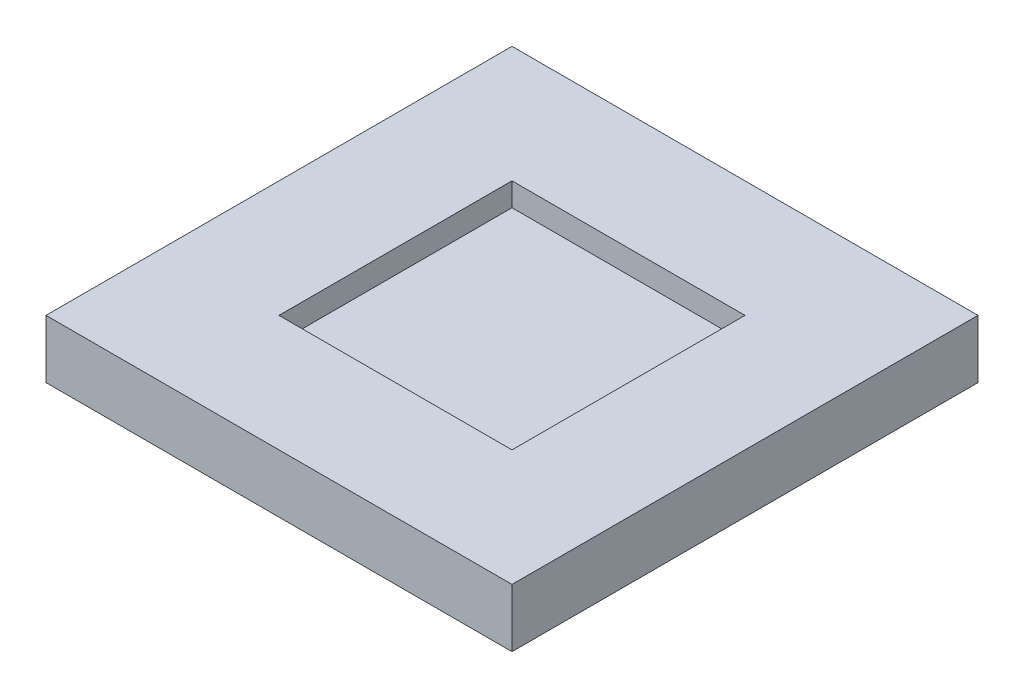
ISO-10303-21;
HEADER;
FILE_DESCRIPTION(('STEP AP214'),'2;1');
FILE_NAME('part.step','',(''),(''),'','','');
FILE_SCHEMA(('AUTOMOTIVE_DESIGN { 1 0 10303 214 1 1 1 1 }'));
ENDSEC;
DATA;
#1=APPLICATION_CONTEXT('core data for automotive mechanical design processes');
#2=APPLICATION_PROTOCOL_DEFINITION('international standard','automotive_design',2000,#1);
#3=PRODUCT_CONTEXT('',#1,'mechanical');
#4=PRODUCT('Part','Part','',(#3));
#5=PRODUCT_RELATED_PRODUCT_CATEGORY('part','',(#4));
#6=PRODUCT_DEFINITION_FORMATION('','',#4);
#7=PRODUCT_DEFINITION_CONTEXT('part definition',#1,'design');
#8=PRODUCT_DEFINITION('design','',#6,#7);
#9=PRODUCT_DEFINITION_SHAPE('','',#8);
#10=(LENGTH_UNIT() NAMED_UNIT(*) SI_UNIT(.MILLI.,.METRE.));
#11=(NAMED_UNIT(*) PLANE_ANGLE_UNIT() SI_UNIT($,.RADIAN.));
#12=(NAMED_UNIT(*) SI_UNIT($,.STERADIAN.) SOLID_ANGLE_UNIT());
#13=UNCERTAINTY_MEASURE_WITH_UNIT(LENGTH_MEASURE(1.E-05),#10,'distance_accuracy_value','');
#14=(GEOMETRIC_REPRESENTATION_CONTEXT(3) GLOBAL_UNCERTAINTY_ASSIGNED_CONTEXT((#13)) GLOBAL_UNIT_ASSIGNED_CONTEXT((#10,
#11,#12)) REPRESENTATION_CONTEXT('',''));
#15=CARTESIAN_POINT('',(0.,0.,0.));
#16=DIRECTION('',(0.,0.,1.));
#17=DIRECTION('',(1.,0.,0.));
#18=AXIS2_PLACEMENT_3D('',#15,#16,#17);
#19=CARTESIAN_POINT('',(-50.8,12.7,-50.8));
#20=DIRECTION('',(1.,0.,0.));
#21=DIRECTION('',(0.,0.,-1.));
#22=AXIS2_PLACEMENT_3D('',#19,#20,#21);
#23=PLANE('',#22);
#24=DIRECTION('',(0.,0.,1.));
#25=VECTOR('',#24,1.);
#26=CARTESIAN_POINT('',(-50.8,0.,-50.8));
#27=LINE('',#26,#25);
#28=CARTESIAN_POINT('',(-50.8,0.,-50.8));
#29=VERTEX_POINT('',#28);
#30=CARTESIAN_POINT('',(-50.8,0.,50.8));
#31=VERTEX_POINT('',#30);
#32=EDGE_CURVE('E140',#29,#31,#27,.T.);
#33=ORIENTED_EDGE('',*,*,#32,.T.);
#34=DIRECTION('',(0.,-1.,0.));
#35=VECTOR('',#34,1.);
#36=CARTESIAN_POINT('',(-50.8,12.7,50.8));
#37=LINE('',#36,#35);
#38=CARTESIAN_POINT('',(-50.8,12.7,50.8));
#39=VERTEX_POINT('',#38);
#40=EDGE_CURVE('E11',#39,#31,#37,.T.);
#41=ORIENTED_EDGE('',*,*,#40,.F.);
#42=DIRECTION('',(0.,0.,1.));
#43=VECTOR('',#42,1.);
#44=CARTESIAN_POINT('',(-50.8,12.7,-50.8));
#45=LINE('',#44,#43);
#46=CARTESIAN_POINT('',(-50.8,12.7,-50.8));
#47=VERTEX_POINT('',#46);
#48=EDGE_CURVE('E144',#47,#39,#45,.T.);
#49=ORIENTED_EDGE('',*,*,#48,.F.);
#50=DIRECTION('',(0.,-1.,0.));
#51=VECTOR('',#50,1.);
#52=CARTESIAN_POINT('',(-50.8,12.7,-50.8));
#53=LINE('',#52,#51);
#54=EDGE_CURVE('E150',#47,#29,#53,.T.);
#55=ORIENTED_EDGE('',*,*,#54,.T.);
#56=EDGE_LOOP('',(#33,#41,#49,#55));
#57=FACE_BOUND('',#56,.T.);
#58=ADVANCED_FACE('F32',(#57),#23,.F.);
#59=CARTESIAN_POINT('',(50.8,12.7,50.8));
#60=DIRECTION('',(0.,0.,-1.));
#61=DIRECTION('',(-1.,0.,0.));
#62=AXIS2_PLACEMENT_3D('',#59,#60,#61);
#63=PLANE('',#62);
#64=DIRECTION('',(1.,0.,0.));
#65=VECTOR('',#64,1.);
#66=CARTESIAN_POINT('',(50.8,0.,50.8));
#67=LINE('',#66,#65);
#68=CARTESIAN_POINT('',(50.8,0.,50.8));
#69=VERTEX_POINT('',#68);
#70=EDGE_CURVE('E153',#31,#69,#67,.T.);
#71=ORIENTED_EDGE('',*,*,#70,.T.);
#72=DIRECTION('',(0.,-1.,0.));
#73=VECTOR('',#72,1.);
#74=CARTESIAN_POINT('',(50.8,12.7,50.8));
#75=LINE('',#74,#73);
#76=CARTESIAN_POINT('',(50.8,12.7,50.8));
#77=VERTEX_POINT('',#76);
#78=EDGE_CURVE('E39',#77,#69,#75,.T.);
#79=ORIENTED_EDGE('',*,*,#78,.F.);
#80=DIRECTION('',(1.,0.,0.));
#81=VECTOR('',#80,1.);
#82=CARTESIAN_POINT('',(50.8,12.7,50.8));
#83=LINE('',#82,#81);
#84=EDGE_CURVE('E83',#39,#77,#83,.T.);
#85=ORIENTED_EDGE('',*,*,#84,.F.);
#86=ORIENTED_EDGE('',*,*,#40,.T.);
#87=EDGE_LOOP('',(#71,#79,#85,#86));
#88=FACE_BOUND('',#87,.T.);
#89=ADVANCED_FACE('F182',(#88),#63,.F.);
#90=CARTESIAN_POINT('',(50.8,12.7,-50.8));
#91=DIRECTION('',(-1.,0.,0.));
#92=DIRECTION('',(0.,0.,1.));
#93=AXIS2_PLACEMENT_3D('',#90,#91,#92);
#94=PLANE('',#93);
#95=DIRECTION('',(0.,0.,-1.));
#96=VECTOR('',#95,1.);
#97=CARTESIAN_POINT('',(50.8,0.,-50.8));
#98=LINE('',#97,#96);
#99=CARTESIAN_POINT('',(50.8,0.,-50.8));
#100=VERTEX_POINT('',#99);
#101=EDGE_CURVE('E155',#69,#100,#98,.T.);
#102=ORIENTED_EDGE('',*,*,#101,.T.);
#103=DIRECTION('',(0.,-1.,0.));
#104=VECTOR('',#103,1.);
#105=CARTESIAN_POINT('',(50.8,12.7,-50.8));
#106=LINE('',#105,#104);
#107=CARTESIAN_POINT('',(50.8,12.7,-50.8));
#108=VERTEX_POINT('',#107);
#109=EDGE_CURVE('E159',#108,#100,#106,.T.);
#110=ORIENTED_EDGE('',*,*,#109,.F.);
#111=DIRECTION('',(0.,0.,-1.));
#112=VECTOR('',#111,1.);
#113=CARTESIAN_POINT('',(50.8,12.7,-50.8));
#114=LINE('',#113,#112);
#115=EDGE_CURVE('E147',#77,#108,#114,.T.);
#116=ORIENTED_EDGE('',*,*,#115,.F.);
#117=ORIENTED_EDGE('',*,*,#78,.T.);
#118=EDGE_LOOP('',(#102,#110,#116,#117));
#119=FACE_BOUND('',#118,.T.);
#120=ADVANCED_FACE('F164',(#119),#94,.F.);
#121=CARTESIAN_POINT('',(50.8,12.7,-50.8));
#122=DIRECTION('',(0.,0.,1.));
#123=DIRECTION('',(1.,0.,0.));
#124=AXIS2_PLACEMENT_3D('',#121,#122,#123);
#125=PLANE('',#124);
#126=DIRECTION('',(-1.,0.,0.));
#127=VECTOR('',#126,1.);
#128=CARTESIAN_POINT('',(50.8,0.,-50.8));
#129=LINE('',#128,#127);
#130=EDGE_CURVE('E76',#100,#29,#129,.T.);
#131=ORIENTED_EDGE('',*,*,#130,.T.);
#132=ORIENTED_EDGE('',*,*,#54,.F.);
#133=DIRECTION('',(-1.,0.,0.));
#134=VECTOR('',#133,1.);
#135=CARTESIAN_POINT('',(50.8,12.7,-50.8));
#136=LINE('',#135,#134);
#137=EDGE_CURVE('E55',#108,#47,#136,.T.);
#138=ORIENTED_EDGE('',*,*,#137,.F.);
#139=ORIENTED_EDGE('',*,*,#109,.T.);
#140=EDGE_LOOP('',(#131,#132,#138,#139));
#141=FACE_BOUND('',#140,.T.);
#142=ADVANCED_FACE('F172',(#141),#125,.F.);
#143=CARTESIAN_POINT('',(0.,12.7,0.));
#144=DIRECTION('',(0.,-1.,0.));
#145=DIRECTION('',(0.,0.,-1.));
#146=AXIS2_PLACEMENT_3D('',#143,#144,#145);
#147=PLANE('',#146);
#148=DIRECTION('',(1.,0.,0.));
#149=VECTOR('',#148,1.);
#150=CARTESIAN_POINT('',(25.4,12.7,25.4));
#151=LINE('',#150,#149);
#152=CARTESIAN_POINT('',(-25.4,12.7,25.4));
#153=VERTEX_POINT('',#152);
#154=CARTESIAN_POINT('',(25.4,12.7,25.4));
#155=VERTEX_POINT('',#154);
#156=EDGE_CURVE('E134',#153,#155,#151,.T.);
#157=ORIENTED_EDGE('',*,*,#156,.F.);
#158=DIRECTION('',(0.,0.,1.));
#159=VECTOR('',#158,1.);
#160=CARTESIAN_POINT('',(-25.4,12.7,-25.4));
#161=LINE('',#160,#159);
#162=CARTESIAN_POINT('',(-25.4,12.7,-25.4));
#163=VERTEX_POINT('',#162);
#164=EDGE_CURVE('E46',#163,#153,#161,.T.);
#165=ORIENTED_EDGE('',*,*,#164,.F.);
#166=DIRECTION('',(-1.,0.,0.));
#167=VECTOR('',#166,1.);
#168=CARTESIAN_POINT('',(25.4,12.7,-25.4));
#169=LINE('',#168,#167);
#170=CARTESIAN_POINT('',(25.4,12.7,-25.4));
#171=VERTEX_POINT('',#170);
#172=EDGE_CURVE('E125',#171,#163,#169,.T.);
#173=ORIENTED_EDGE('',*,*,#172,.F.);
#174=DIRECTION('',(0.,0.,-1.));
#175=VECTOR('',#174,1.);
#176=CARTESIAN_POINT('',(25.4,12.7,-25.4));
#177=LINE('',#176,#175);
#178=EDGE_CURVE('E128',#155,#171,#177,.T.);
#179=ORIENTED_EDGE('',*,*,#178,.F.);
#180=EDGE_LOOP('',(#157,#165,#173,#179));
#181=FACE_BOUND('',#180,.T.);
#182=ORIENTED_EDGE('',*,*,#48,.T.);
#183=ORIENTED_EDGE('',*,*,#84,.T.);
#184=ORIENTED_EDGE('',*,*,#115,.T.);
#185=ORIENTED_EDGE('',*,*,#137,.T.);
#186=EDGE_LOOP('',(#182,#183,#184,#185));
#187=FACE_BOUND('',#186,.T.);
#188=ADVANCED_FACE('F174',(#181,#187),#147,.F.);
#189=CARTESIAN_POINT('',(0.,0.,0.));
#190=DIRECTION('',(0.,-1.,0.));
#191=DIRECTION('',(0.,0.,-1.));
#192=AXIS2_PLACEMENT_3D('',#189,#190,#191);
#193=PLANE('',#192);
#194=ORIENTED_EDGE('',*,*,#32,.F.);
#195=ORIENTED_EDGE('',*,*,#130,.F.);
#196=ORIENTED_EDGE('',*,*,#101,.F.);
#197=ORIENTED_EDGE('',*,*,#70,.F.);
#198=EDGE_LOOP('',(#194,#195,#196,#197));
#199=FACE_BOUND('',#198,.T.);
#200=ADVANCED_FACE('F168',(#199),#193,.T.);
#201=CARTESIAN_POINT('',(-25.4,7.62,-25.4));
#202=DIRECTION('',(-1.,0.,0.));
#203=DIRECTION('',(0.,0.,1.));
#204=AXIS2_PLACEMENT_3D('',#201,#202,#203);
#205=PLANE('',#204);
#206=ORIENTED_EDGE('',*,*,#164,.T.);
#207=DIRECTION('',(0.,1.,0.));
#208=VECTOR('',#207,1.);
#209=CARTESIAN_POINT('',(-25.4,7.62,25.4));
#210=LINE('',#209,#208);
#211=CARTESIAN_POINT('',(-25.4,7.62,25.4));
#212=VERTEX_POINT('',#211);
#213=EDGE_CURVE('E103',#212,#153,#210,.T.);
#214=ORIENTED_EDGE('',*,*,#213,.F.);
#215=DIRECTION('',(0.,0.,1.));
#216=VECTOR('',#215,1.);
#217=CARTESIAN_POINT('',(-25.4,7.62,-25.4));
#218=LINE('',#217,#216);
#219=CARTESIAN_POINT('',(-25.4,7.62,-25.4));
#220=VERTEX_POINT('',#219);
#221=EDGE_CURVE('E107',#220,#212,#218,.T.);
#222=ORIENTED_EDGE('',*,*,#221,.F.);
#223=DIRECTION('',(0.,1.,0.));
#224=VECTOR('',#223,1.);
#225=CARTESIAN_POINT('',(-25.4,7.62,-25.4));
#226=LINE('',#225,#224);
#227=EDGE_CURVE('E138',#220,#163,#226,.T.);
#228=ORIENTED_EDGE('',*,*,#227,.T.);
#229=EDGE_LOOP('',(#206,#214,#222,#228));
#230=FACE_BOUND('',#229,.T.);
#231=ADVANCED_FACE('F105',(#230),#205,.F.);
#232=CARTESIAN_POINT('',(25.4,7.62,-25.4));
#233=DIRECTION('',(0.,0.,-1.));
#234=DIRECTION('',(-1.,0.,0.));
#235=AXIS2_PLACEMENT_3D('',#232,#233,#234);
#236=PLANE('',#235);
#237=ORIENTED_EDGE('',*,*,#172,.T.);
#238=ORIENTED_EDGE('',*,*,#227,.F.);
#239=DIRECTION('',(-1.,0.,0.));
#240=VECTOR('',#239,1.);
#241=CARTESIAN_POINT('',(25.4,7.62,-25.4));
#242=LINE('',#241,#240);
#243=CARTESIAN_POINT('',(25.4,7.62,-25.4));
#244=VERTEX_POINT('',#243);
#245=EDGE_CURVE('E113',#244,#220,#242,.T.);
#246=ORIENTED_EDGE('',*,*,#245,.F.);
#247=DIRECTION('',(0.,1.,0.));
#248=VECTOR('',#247,1.);
#249=CARTESIAN_POINT('',(25.4,7.62,-25.4));
#250=LINE('',#249,#248);
#251=EDGE_CURVE('E141',#244,#171,#250,.T.);
#252=ORIENTED_EDGE('',*,*,#251,.T.);
#253=EDGE_LOOP('',(#237,#238,#246,#252));
#254=FACE_BOUND('',#253,.T.);
#255=ADVANCED_FACE('F221',(#254),#236,.F.);
#256=CARTESIAN_POINT('',(25.4,7.62,-25.4));
#257=DIRECTION('',(1.,0.,0.));
#258=DIRECTION('',(0.,0.,-1.));
#259=AXIS2_PLACEMENT_3D('',#256,#257,#258);
#260=PLANE('',#259);
#261=ORIENTED_EDGE('',*,*,#178,.T.);
#262=ORIENTED_EDGE('',*,*,#251,.F.);
#263=DIRECTION('',(0.,0.,-1.));
#264=VECTOR('',#263,1.);
#265=CARTESIAN_POINT('',(25.4,7.62,-25.4));
#266=LINE('',#265,#264);
#267=CARTESIAN_POINT('',(25.4,7.62,25.4));
#268=VERTEX_POINT('',#267);
#269=EDGE_CURVE('E121',#268,#244,#266,.T.);
#270=ORIENTED_EDGE('',*,*,#269,.F.);
#271=DIRECTION('',(0.,1.,0.));
#272=VECTOR('',#271,1.);
#273=CARTESIAN_POINT('',(25.4,7.62,25.4));
#274=LINE('',#273,#272);
#275=EDGE_CURVE('E112',#268,#155,#274,.T.);
#276=ORIENTED_EDGE('',*,*,#275,.T.);
#277=EDGE_LOOP('',(#261,#262,#270,#276));
#278=FACE_BOUND('',#277,.T.);
#279=ADVANCED_FACE('F230',(#278),#260,.F.);
#280=CARTESIAN_POINT('',(25.4,7.62,25.4));
#281=DIRECTION('',(0.,0.,1.));
#282=DIRECTION('',(1.,0.,0.));
#283=AXIS2_PLACEMENT_3D('',#280,#281,#282);
#284=PLANE('',#283);
#285=ORIENTED_EDGE('',*,*,#156,.T.);
#286=ORIENTED_EDGE('',*,*,#275,.F.);
#287=DIRECTION('',(1.,0.,0.));
#288=VECTOR('',#287,1.);
#289=CARTESIAN_POINT('',(25.4,7.62,25.4));
#290=LINE('',#289,#288);
#291=EDGE_CURVE('E116',#212,#268,#290,.T.);
#292=ORIENTED_EDGE('',*,*,#291,.F.);
#293=ORIENTED_EDGE('',*,*,#213,.T.);
#294=EDGE_LOOP('',(#285,#286,#292,#293));
#295=FACE_BOUND('',#294,.T.);
#296=ADVANCED_FACE('F117',(#295),#284,.F.);
#297=CARTESIAN_POINT('',(0.,7.62,0.));
#298=DIRECTION('',(0.,-1.,0.));
#299=DIRECTION('',(0.,0.,-1.));
#300=AXIS2_PLACEMENT_3D('',#297,#298,#299);
#301=PLANE('',#300);
#302=ORIENTED_EDGE('',*,*,#221,.T.);
#303=ORIENTED_EDGE('',*,*,#291,.T.);
#304=ORIENTED_EDGE('',*,*,#269,.T.);
#305=ORIENTED_EDGE('',*,*,#245,.T.);
#306=EDGE_LOOP('',(#302,#303,#304,#305));
#307=FACE_BOUND('',#306,.T.);
#308=ADVANCED_FACE('F123',(#307),#301,.F.);
#309=CLOSED_SHELL('',(#58,#89,#120,#142,#188,#200,#231,#255,#279,#296,#308));
#310=MANIFOLD_SOLID_BREP('B2',#309);
#311=ADVANCED_BREP_SHAPE_REPRESENTATION('',(#18,#310),#14);
#312=SHAPE_DEFINITION_REPRESENTATION(#9,#311);
ENDSEC;
END-ISO-10303-21;
